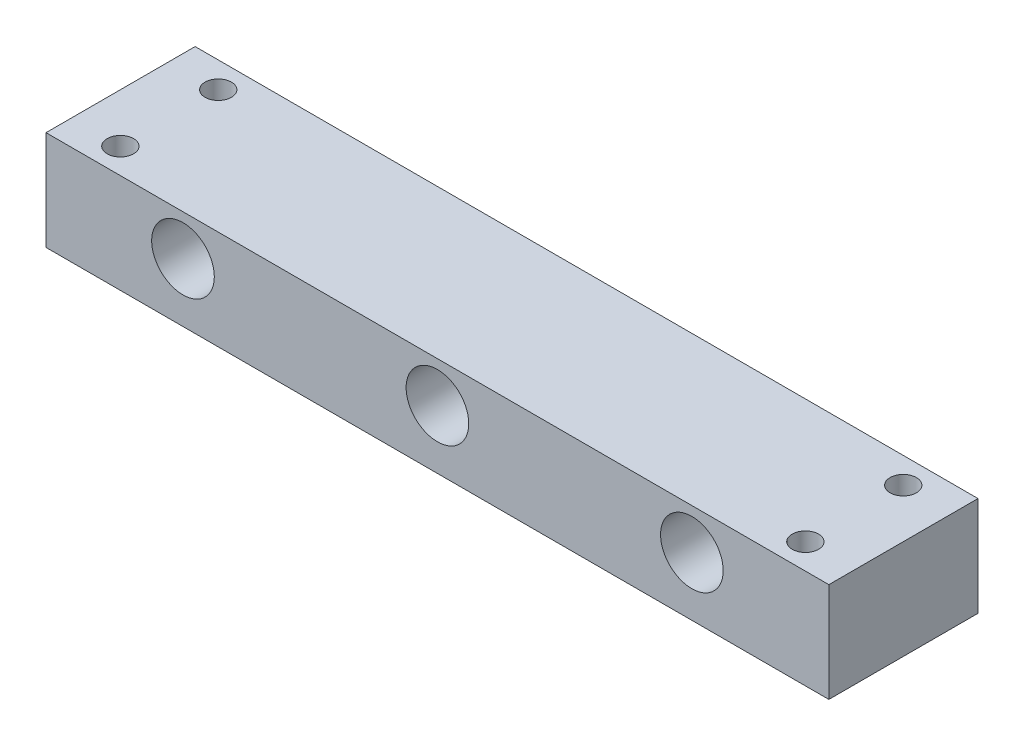
ISO-10303-21;
HEADER;
FILE_DESCRIPTION(('STEP AP214'),'2;1');
FILE_NAME('part.step','',(''),(''),'','','');
FILE_SCHEMA(('AUTOMOTIVE_DESIGN { 1 0 10303 214 1 1 1 1 }'));
ENDSEC;
DATA;
#1=APPLICATION_CONTEXT('core data for automotive mechanical design processes');
#2=APPLICATION_PROTOCOL_DEFINITION('international standard','automotive_design',2000,#1);
#3=PRODUCT_CONTEXT('',#1,'mechanical');
#4=PRODUCT('Part','Part','',(#3));
#5=PRODUCT_RELATED_PRODUCT_CATEGORY('part','',(#4));
#6=PRODUCT_DEFINITION_FORMATION('','',#4);
#7=PRODUCT_DEFINITION_CONTEXT('part definition',#1,'design');
#8=PRODUCT_DEFINITION('design','',#6,#7);
#9=PRODUCT_DEFINITION_SHAPE('','',#8);
#10=(LENGTH_UNIT() NAMED_UNIT(*) SI_UNIT(.MILLI.,.METRE.));
#11=(NAMED_UNIT(*) PLANE_ANGLE_UNIT() SI_UNIT($,.RADIAN.));
#12=(NAMED_UNIT(*) SI_UNIT($,.STERADIAN.) SOLID_ANGLE_UNIT());
#13=UNCERTAINTY_MEASURE_WITH_UNIT(LENGTH_MEASURE(1.E-05),#10,'distance_accuracy_value','');
#14=(GEOMETRIC_REPRESENTATION_CONTEXT(3) GLOBAL_UNCERTAINTY_ASSIGNED_CONTEXT((#13)) GLOBAL_UNIT_ASSIGNED_CONTEXT((#10,
#11,#12)) REPRESENTATION_CONTEXT('',''));
#15=CARTESIAN_POINT('',(0.,0.,0.));
#16=DIRECTION('',(0.,0.,1.));
#17=DIRECTION('',(1.,0.,0.));
#18=AXIS2_PLACEMENT_3D('',#15,#16,#17);
#19=CARTESIAN_POINT('',(0.,50.8,0.));
#20=DIRECTION('',(1.,0.,0.));
#21=DIRECTION('',(0.,0.,-1.));
#22=AXIS2_PLACEMENT_3D('',#19,#20,#21);
#23=PLANE('',#22);
#24=DIRECTION('',(0.,0.,1.));
#25=VECTOR('',#24,1.);
#26=CARTESIAN_POINT('',(0.,0.,0.));
#27=LINE('',#26,#25);
#28=CARTESIAN_POINT('',(0.,0.,-76.2));
#29=VERTEX_POINT('',#28);
#30=CARTESIAN_POINT('',(0.,0.,0.));
#31=VERTEX_POINT('',#30);
#32=EDGE_CURVE('E96',#29,#31,#27,.T.);
#33=ORIENTED_EDGE('',*,*,#32,.T.);
#34=DIRECTION('',(0.,-1.,0.));
#35=VECTOR('',#34,1.);
#36=CARTESIAN_POINT('',(0.,50.8,0.));
#37=LINE('',#36,#35);
#38=CARTESIAN_POINT('',(0.,50.8,0.));
#39=VERTEX_POINT('',#38);
#40=EDGE_CURVE('E11',#39,#31,#37,.T.);
#41=ORIENTED_EDGE('',*,*,#40,.F.);
#42=DIRECTION('',(0.,0.,1.));
#43=VECTOR('',#42,1.);
#44=CARTESIAN_POINT('',(0.,50.8,0.));
#45=LINE('',#44,#43);
#46=CARTESIAN_POINT('',(0.,50.8,-76.2));
#47=VERTEX_POINT('',#46);
#48=EDGE_CURVE('E84',#47,#39,#45,.T.);
#49=ORIENTED_EDGE('',*,*,#48,.F.);
#50=DIRECTION('',(0.,-1.,0.));
#51=VECTOR('',#50,1.);
#52=CARTESIAN_POINT('',(0.,50.8,-76.2));
#53=LINE('',#52,#51);
#54=EDGE_CURVE('E92',#47,#29,#53,.T.);
#55=ORIENTED_EDGE('',*,*,#54,.T.);
#56=EDGE_LOOP('',(#33,#41,#49,#55));
#57=FACE_BOUND('',#56,.T.);
#58=ADVANCED_FACE('F33',(#57),#23,.F.);
#59=CARTESIAN_POINT('',(0.,50.8,0.));
#60=DIRECTION('',(0.,0.,-1.));
#61=DIRECTION('',(-1.,0.,0.));
#62=AXIS2_PLACEMENT_3D('',#59,#60,#61);
#63=PLANE('',#62);
#64=CARTESIAN_POINT('',(330.,30.,0.));
#65=DIRECTION('',(0.,0.,1.));
#66=DIRECTION('',(1.,0.,0.));
#67=AXIS2_PLACEMENT_3D('',#64,#65,#66);
#68=CIRCLE('',#67,16.);
#69=CARTESIAN_POINT('',(346.,30.,0.));
#70=VERTEX_POINT('',#69);
#71=EDGE_CURVE('E146',#70,#70,#68,.T.);
#72=ORIENTED_EDGE('',*,*,#71,.F.);
#73=EDGE_LOOP('',(#72));
#74=FACE_BOUND('',#73,.T.);
#75=CARTESIAN_POINT('',(200.,30.,0.));
#76=DIRECTION('',(0.,0.,1.));
#77=DIRECTION('',(1.,0.,0.));
#78=AXIS2_PLACEMENT_3D('',#75,#76,#77);
#79=CIRCLE('',#78,16.);
#80=CARTESIAN_POINT('',(216.,30.,0.));
#81=VERTEX_POINT('',#80);
#82=EDGE_CURVE('E140',#81,#81,#79,.T.);
#83=ORIENTED_EDGE('',*,*,#82,.F.);
#84=EDGE_LOOP('',(#83));
#85=FACE_BOUND('',#84,.T.);
#86=CARTESIAN_POINT('',(70.,30.,0.));
#87=DIRECTION('',(0.,0.,1.));
#88=DIRECTION('',(1.,0.,0.));
#89=AXIS2_PLACEMENT_3D('',#86,#87,#88);
#90=CIRCLE('',#89,16.);
#91=CARTESIAN_POINT('',(86.,30.,0.));
#92=VERTEX_POINT('',#91);
#93=EDGE_CURVE('E134',#92,#92,#90,.T.);
#94=ORIENTED_EDGE('',*,*,#93,.F.);
#95=EDGE_LOOP('',(#94));
#96=FACE_BOUND('',#95,.T.);
#97=DIRECTION('',(1.,0.,0.));
#98=VECTOR('',#97,1.);
#99=CARTESIAN_POINT('',(0.,0.,0.));
#100=LINE('',#99,#98);
#101=CARTESIAN_POINT('',(400.,0.,0.));
#102=VERTEX_POINT('',#101);
#103=EDGE_CURVE('E88',#31,#102,#100,.T.);
#104=ORIENTED_EDGE('',*,*,#103,.T.);
#105=DIRECTION('',(0.,-1.,0.));
#106=VECTOR('',#105,1.);
#107=CARTESIAN_POINT('',(400.,50.8,0.));
#108=LINE('',#107,#106);
#109=CARTESIAN_POINT('',(400.,50.8,0.));
#110=VERTEX_POINT('',#109);
#111=EDGE_CURVE('E41',#110,#102,#108,.T.);
#112=ORIENTED_EDGE('',*,*,#111,.F.);
#113=DIRECTION('',(1.,0.,0.));
#114=VECTOR('',#113,1.);
#115=CARTESIAN_POINT('',(0.,50.8,0.));
#116=LINE('',#115,#114);
#117=EDGE_CURVE('E79',#39,#110,#116,.T.);
#118=ORIENTED_EDGE('',*,*,#117,.F.);
#119=ORIENTED_EDGE('',*,*,#40,.T.);
#120=EDGE_LOOP('',(#104,#112,#118,#119));
#121=FACE_BOUND('',#120,.T.);
#122=ADVANCED_FACE('F87',(#74,#85,#96,#121),#63,.F.);
#123=CARTESIAN_POINT('',(400.,50.8,0.));
#124=DIRECTION('',(-1.,0.,0.));
#125=DIRECTION('',(0.,0.,1.));
#126=AXIS2_PLACEMENT_3D('',#123,#124,#125);
#127=PLANE('',#126);
#128=DIRECTION('',(0.,0.,-1.));
#129=VECTOR('',#128,1.);
#130=CARTESIAN_POINT('',(400.,0.,0.));
#131=LINE('',#130,#129);
#132=CARTESIAN_POINT('',(400.,0.,-76.2));
#133=VERTEX_POINT('',#132);
#134=EDGE_CURVE('E66',#102,#133,#131,.T.);
#135=ORIENTED_EDGE('',*,*,#134,.T.);
#136=DIRECTION('',(0.,-1.,0.));
#137=VECTOR('',#136,1.);
#138=CARTESIAN_POINT('',(400.,50.8,-76.2));
#139=LINE('',#138,#137);
#140=CARTESIAN_POINT('',(400.,50.8,-76.2));
#141=VERTEX_POINT('',#140);
#142=EDGE_CURVE('E89',#141,#133,#139,.T.);
#143=ORIENTED_EDGE('',*,*,#142,.F.);
#144=DIRECTION('',(0.,0.,-1.));
#145=VECTOR('',#144,1.);
#146=CARTESIAN_POINT('',(400.,50.8,0.));
#147=LINE('',#146,#145);
#148=EDGE_CURVE('E82',#110,#141,#147,.T.);
#149=ORIENTED_EDGE('',*,*,#148,.F.);
#150=ORIENTED_EDGE('',*,*,#111,.T.);
#151=EDGE_LOOP('',(#135,#143,#149,#150));
#152=FACE_BOUND('',#151,.T.);
#153=ADVANCED_FACE('F90',(#152),#127,.F.);
#154=CARTESIAN_POINT('',(0.,50.8,-76.2));
#155=DIRECTION('',(0.,0.,1.));
#156=DIRECTION('',(1.,0.,0.));
#157=AXIS2_PLACEMENT_3D('',#154,#155,#156);
#158=PLANE('',#157);
#159=CARTESIAN_POINT('',(330.,30.,-76.2));
#160=DIRECTION('',(0.,0.,1.));
#161=DIRECTION('',(1.,0.,0.));
#162=AXIS2_PLACEMENT_3D('',#159,#160,#161);
#163=CIRCLE('',#162,16.);
#164=CARTESIAN_POINT('',(346.,30.,-76.2));
#165=VERTEX_POINT('',#164);
#166=EDGE_CURVE('E143',#165,#165,#163,.T.);
#167=ORIENTED_EDGE('',*,*,#166,.T.);
#168=EDGE_LOOP('',(#167));
#169=FACE_BOUND('',#168,.T.);
#170=CARTESIAN_POINT('',(200.,30.,-76.2));
#171=DIRECTION('',(0.,0.,1.));
#172=DIRECTION('',(1.,0.,0.));
#173=AXIS2_PLACEMENT_3D('',#170,#171,#172);
#174=CIRCLE('',#173,16.);
#175=CARTESIAN_POINT('',(216.,30.,-76.2));
#176=VERTEX_POINT('',#175);
#177=EDGE_CURVE('E137',#176,#176,#174,.T.);
#178=ORIENTED_EDGE('',*,*,#177,.T.);
#179=EDGE_LOOP('',(#178));
#180=FACE_BOUND('',#179,.T.);
#181=CARTESIAN_POINT('',(70.,30.,-76.2));
#182=DIRECTION('',(0.,0.,1.));
#183=DIRECTION('',(1.,0.,0.));
#184=AXIS2_PLACEMENT_3D('',#181,#182,#183);
#185=CIRCLE('',#184,16.);
#186=CARTESIAN_POINT('',(86.,30.,-76.2));
#187=VERTEX_POINT('',#186);
#188=EDGE_CURVE('E131',#187,#187,#185,.T.);
#189=ORIENTED_EDGE('',*,*,#188,.T.);
#190=EDGE_LOOP('',(#189));
#191=FACE_BOUND('',#190,.T.);
#192=DIRECTION('',(-1.,0.,0.));
#193=VECTOR('',#192,1.);
#194=CARTESIAN_POINT('',(0.,0.,-76.2));
#195=LINE('',#194,#193);
#196=EDGE_CURVE('E72',#133,#29,#195,.T.);
#197=ORIENTED_EDGE('',*,*,#196,.T.);
#198=ORIENTED_EDGE('',*,*,#54,.F.);
#199=DIRECTION('',(-1.,0.,0.));
#200=VECTOR('',#199,1.);
#201=CARTESIAN_POINT('',(0.,50.8,-76.2));
#202=LINE('',#201,#200);
#203=EDGE_CURVE('E49',#141,#47,#202,.T.);
#204=ORIENTED_EDGE('',*,*,#203,.F.);
#205=ORIENTED_EDGE('',*,*,#142,.T.);
#206=EDGE_LOOP('',(#197,#198,#204,#205));
#207=FACE_BOUND('',#206,.T.);
#208=ADVANCED_FACE('F104',(#169,#180,#191,#207),#158,.F.);
#209=CARTESIAN_POINT('',(0.,50.8,-76.2));
#210=DIRECTION('',(0.,-1.,0.));
#211=DIRECTION('',(0.,0.,-1.));
#212=AXIS2_PLACEMENT_3D('',#209,#210,#211);
#213=PLANE('',#212);
#214=CARTESIAN_POINT('',(25.,50.8,-63.));
#215=DIRECTION('',(0.,1.,0.));
#216=DIRECTION('',(0.,0.,1.));
#217=AXIS2_PLACEMENT_3D('',#214,#215,#216);
#218=CIRCLE('',#217,6.75);
#219=CARTESIAN_POINT('',(25.,50.8,-56.25));
#220=VERTEX_POINT('',#219);
#221=EDGE_CURVE('E125',#220,#220,#218,.T.);
#222=ORIENTED_EDGE('',*,*,#221,.F.);
#223=EDGE_LOOP('',(#222));
#224=FACE_BOUND('',#223,.T.);
#225=CARTESIAN_POINT('',(375.,50.8,-13.));
#226=DIRECTION('',(0.,1.,0.));
#227=DIRECTION('',(0.,0.,1.));
#228=AXIS2_PLACEMENT_3D('',#225,#226,#227);
#229=CIRCLE('',#228,6.74999999999997);
#230=CARTESIAN_POINT('',(375.,50.8,-6.25000000000002));
#231=VERTEX_POINT('',#230);
#232=EDGE_CURVE('E119',#231,#231,#229,.T.);
#233=ORIENTED_EDGE('',*,*,#232,.F.);
#234=EDGE_LOOP('',(#233));
#235=FACE_BOUND('',#234,.T.);
#236=CARTESIAN_POINT('',(25.,50.8,-13.));
#237=DIRECTION('',(0.,1.,0.));
#238=DIRECTION('',(0.,0.,1.));
#239=AXIS2_PLACEMENT_3D('',#236,#237,#238);
#240=CIRCLE('',#239,6.75);
#241=CARTESIAN_POINT('',(25.,50.8,-6.24999999999999));
#242=VERTEX_POINT('',#241);
#243=EDGE_CURVE('E113',#242,#242,#240,.T.);
#244=ORIENTED_EDGE('',*,*,#243,.F.);
#245=EDGE_LOOP('',(#244));
#246=FACE_BOUND('',#245,.T.);
#247=CARTESIAN_POINT('',(375.,50.8,-63.));
#248=DIRECTION('',(0.,1.,0.));
#249=DIRECTION('',(0.,0.,1.));
#250=AXIS2_PLACEMENT_3D('',#247,#248,#249);
#251=CIRCLE('',#250,6.74999999999997);
#252=CARTESIAN_POINT('',(375.,50.8,-56.25));
#253=VERTEX_POINT('',#252);
#254=EDGE_CURVE('E110',#253,#253,#251,.T.);
#255=ORIENTED_EDGE('',*,*,#254,.F.);
#256=EDGE_LOOP('',(#255));
#257=FACE_BOUND('',#256,.T.);
#258=ORIENTED_EDGE('',*,*,#48,.T.);
#259=ORIENTED_EDGE('',*,*,#117,.T.);
#260=ORIENTED_EDGE('',*,*,#148,.T.);
#261=ORIENTED_EDGE('',*,*,#203,.T.);
#262=EDGE_LOOP('',(#258,#259,#260,#261));
#263=FACE_BOUND('',#262,.T.);
#264=ADVANCED_FACE('F80',(#224,#235,#246,#257,#263),#213,.F.);
#265=CARTESIAN_POINT('',(0.,0.,-76.2));
#266=DIRECTION('',(0.,-1.,0.));
#267=DIRECTION('',(0.,0.,-1.));
#268=AXIS2_PLACEMENT_3D('',#265,#266,#267);
#269=PLANE('',#268);
#270=CARTESIAN_POINT('',(25.,0.,-63.));
#271=DIRECTION('',(0.,1.,0.));
#272=DIRECTION('',(0.,0.,1.));
#273=AXIS2_PLACEMENT_3D('',#270,#271,#272);
#274=CIRCLE('',#273,6.75);
#275=CARTESIAN_POINT('',(25.,0.,-56.25));
#276=VERTEX_POINT('',#275);
#277=EDGE_CURVE('E128',#276,#276,#274,.T.);
#278=ORIENTED_EDGE('',*,*,#277,.T.);
#279=EDGE_LOOP('',(#278));
#280=FACE_BOUND('',#279,.T.);
#281=CARTESIAN_POINT('',(375.,0.,-13.));
#282=DIRECTION('',(0.,1.,0.));
#283=DIRECTION('',(0.,0.,1.));
#284=AXIS2_PLACEMENT_3D('',#281,#282,#283);
#285=CIRCLE('',#284,6.74999999999997);
#286=CARTESIAN_POINT('',(375.,0.,-6.25000000000002));
#287=VERTEX_POINT('',#286);
#288=EDGE_CURVE('E122',#287,#287,#285,.T.);
#289=ORIENTED_EDGE('',*,*,#288,.T.);
#290=EDGE_LOOP('',(#289));
#291=FACE_BOUND('',#290,.T.);
#292=CARTESIAN_POINT('',(25.,0.,-13.));
#293=DIRECTION('',(0.,1.,0.));
#294=DIRECTION('',(0.,0.,1.));
#295=AXIS2_PLACEMENT_3D('',#292,#293,#294);
#296=CIRCLE('',#295,6.75);
#297=CARTESIAN_POINT('',(25.,0.,-6.24999999999999));
#298=VERTEX_POINT('',#297);
#299=EDGE_CURVE('E116',#298,#298,#296,.T.);
#300=ORIENTED_EDGE('',*,*,#299,.T.);
#301=EDGE_LOOP('',(#300));
#302=FACE_BOUND('',#301,.T.);
#303=CARTESIAN_POINT('',(375.,0.,-63.));
#304=DIRECTION('',(0.,1.,0.));
#305=DIRECTION('',(0.,0.,1.));
#306=AXIS2_PLACEMENT_3D('',#303,#304,#305);
#307=CIRCLE('',#306,6.74999999999997);
#308=CARTESIAN_POINT('',(375.,0.,-56.25));
#309=VERTEX_POINT('',#308);
#310=EDGE_CURVE('E99',#309,#309,#307,.T.);
#311=ORIENTED_EDGE('',*,*,#310,.T.);
#312=EDGE_LOOP('',(#311));
#313=FACE_BOUND('',#312,.T.);
#314=ORIENTED_EDGE('',*,*,#32,.F.);
#315=ORIENTED_EDGE('',*,*,#196,.F.);
#316=ORIENTED_EDGE('',*,*,#134,.F.);
#317=ORIENTED_EDGE('',*,*,#103,.F.);
#318=EDGE_LOOP('',(#314,#315,#316,#317));
#319=FACE_BOUND('',#318,.T.);
#320=ADVANCED_FACE('F107',(#280,#291,#302,#313,#319),#269,.T.);
#321=CARTESIAN_POINT('',(375.,0.,-63.));
#322=DIRECTION('',(0.,1.,0.));
#323=DIRECTION('',(0.,0.,1.));
#324=AXIS2_PLACEMENT_3D('',#321,#322,#323);
#325=CYLINDRICAL_SURFACE('',#324,6.74999999999997);
#326=ORIENTED_EDGE('',*,*,#310,.F.);
#327=EDGE_LOOP('',(#326));
#328=FACE_BOUND('',#327,.T.);
#329=ORIENTED_EDGE('',*,*,#254,.T.);
#330=EDGE_LOOP('',(#329));
#331=FACE_BOUND('',#330,.T.);
#332=ADVANCED_FACE('F215',(#328,#331),#325,.F.);
#333=CARTESIAN_POINT('',(25.,0.,-13.));
#334=DIRECTION('',(0.,1.,0.));
#335=DIRECTION('',(0.,0.,1.));
#336=AXIS2_PLACEMENT_3D('',#333,#334,#335);
#337=CYLINDRICAL_SURFACE('',#336,6.75);
#338=ORIENTED_EDGE('',*,*,#299,.F.);
#339=EDGE_LOOP('',(#338));
#340=FACE_BOUND('',#339,.T.);
#341=ORIENTED_EDGE('',*,*,#243,.T.);
#342=EDGE_LOOP('',(#341));
#343=FACE_BOUND('',#342,.T.);
#344=ADVANCED_FACE('F223',(#340,#343),#337,.F.);
#345=CARTESIAN_POINT('',(375.,0.,-13.));
#346=DIRECTION('',(0.,1.,0.));
#347=DIRECTION('',(0.,0.,1.));
#348=AXIS2_PLACEMENT_3D('',#345,#346,#347);
#349=CYLINDRICAL_SURFACE('',#348,6.74999999999997);
#350=ORIENTED_EDGE('',*,*,#288,.F.);
#351=EDGE_LOOP('',(#350));
#352=FACE_BOUND('',#351,.T.);
#353=ORIENTED_EDGE('',*,*,#232,.T.);
#354=EDGE_LOOP('',(#353));
#355=FACE_BOUND('',#354,.T.);
#356=ADVANCED_FACE('F178',(#352,#355),#349,.F.);
#357=CARTESIAN_POINT('',(25.,0.,-63.));
#358=DIRECTION('',(0.,1.,0.));
#359=DIRECTION('',(0.,0.,1.));
#360=AXIS2_PLACEMENT_3D('',#357,#358,#359);
#361=CYLINDRICAL_SURFACE('',#360,6.75);
#362=ORIENTED_EDGE('',*,*,#277,.F.);
#363=EDGE_LOOP('',(#362));
#364=FACE_BOUND('',#363,.T.);
#365=ORIENTED_EDGE('',*,*,#221,.T.);
#366=EDGE_LOOP('',(#365));
#367=FACE_BOUND('',#366,.T.);
#368=ADVANCED_FACE('F169',(#364,#367),#361,.F.);
#369=CARTESIAN_POINT('',(70.,30.,-76.2));
#370=DIRECTION('',(0.,0.,1.));
#371=DIRECTION('',(1.,0.,0.));
#372=AXIS2_PLACEMENT_3D('',#369,#370,#371);
#373=CYLINDRICAL_SURFACE('',#372,16.);
#374=ORIENTED_EDGE('',*,*,#188,.F.);
#375=EDGE_LOOP('',(#374));
#376=FACE_BOUND('',#375,.T.);
#377=ORIENTED_EDGE('',*,*,#93,.T.);
#378=EDGE_LOOP('',(#377));
#379=FACE_BOUND('',#378,.T.);
#380=ADVANCED_FACE('F167',(#376,#379),#373,.F.);
#381=CARTESIAN_POINT('',(200.,30.,-76.2));
#382=DIRECTION('',(0.,0.,1.));
#383=DIRECTION('',(1.,0.,0.));
#384=AXIS2_PLACEMENT_3D('',#381,#382,#383);
#385=CYLINDRICAL_SURFACE('',#384,16.);
#386=ORIENTED_EDGE('',*,*,#177,.F.);
#387=EDGE_LOOP('',(#386));
#388=FACE_BOUND('',#387,.T.);
#389=ORIENTED_EDGE('',*,*,#82,.T.);
#390=EDGE_LOOP('',(#389));
#391=FACE_BOUND('',#390,.T.);
#392=ADVANCED_FACE('F157',(#388,#391),#385,.F.);
#393=CARTESIAN_POINT('',(330.,30.,-76.2));
#394=DIRECTION('',(0.,0.,1.));
#395=DIRECTION('',(1.,0.,0.));
#396=AXIS2_PLACEMENT_3D('',#393,#394,#395);
#397=CYLINDRICAL_SURFACE('',#396,16.);
#398=ORIENTED_EDGE('',*,*,#166,.F.);
#399=EDGE_LOOP('',(#398));
#400=FACE_BOUND('',#399,.T.);
#401=ORIENTED_EDGE('',*,*,#71,.T.);
#402=EDGE_LOOP('',(#401));
#403=FACE_BOUND('',#402,.T.);
#404=ADVANCED_FACE('F154',(#400,#403),#397,.F.);
#405=CLOSED_SHELL('',(#58,#122,#153,#208,#264,#320,#332,#344,#356,#368,#380,#392,#404));
#406=MANIFOLD_SOLID_BREP('B2',#405);
#407=ADVANCED_BREP_SHAPE_REPRESENTATION('',(#18,#406),#14);
#408=SHAPE_DEFINITION_REPRESENTATION(#9,#407);
ENDSEC;
END-ISO-10303-21;
